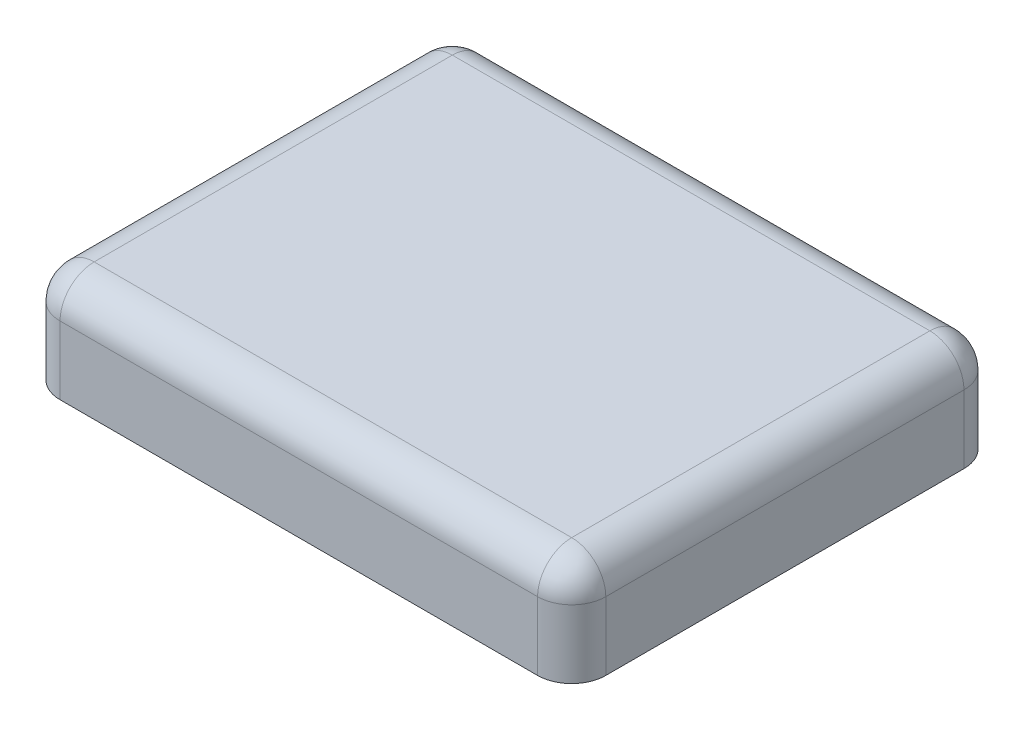
ISO-10303-21;
HEADER;
FILE_DESCRIPTION(('STEP AP214'),'2;1');
FILE_NAME('part.step','',(''),(''),'','','');
FILE_SCHEMA(('AUTOMOTIVE_DESIGN { 1 0 10303 214 1 1 1 1 }'));
ENDSEC;
DATA;
#1=APPLICATION_CONTEXT('core data for automotive mechanical design processes');
#2=APPLICATION_PROTOCOL_DEFINITION('international standard','automotive_design',2000,#1);
#3=PRODUCT_CONTEXT('',#1,'mechanical');
#4=PRODUCT('Part','Part','',(#3));
#5=PRODUCT_RELATED_PRODUCT_CATEGORY('part','',(#4));
#6=PRODUCT_DEFINITION_FORMATION('','',#4);
#7=PRODUCT_DEFINITION_CONTEXT('part definition',#1,'design');
#8=PRODUCT_DEFINITION('design','',#6,#7);
#9=PRODUCT_DEFINITION_SHAPE('','',#8);
#10=(LENGTH_UNIT() NAMED_UNIT(*) SI_UNIT(.MILLI.,.METRE.));
#11=(NAMED_UNIT(*) PLANE_ANGLE_UNIT() SI_UNIT($,.RADIAN.));
#12=(NAMED_UNIT(*) SI_UNIT($,.STERADIAN.) SOLID_ANGLE_UNIT());
#13=UNCERTAINTY_MEASURE_WITH_UNIT(LENGTH_MEASURE(1.E-05),#10,'distance_accuracy_value','');
#14=(GEOMETRIC_REPRESENTATION_CONTEXT(3) GLOBAL_UNCERTAINTY_ASSIGNED_CONTEXT((#13)) GLOBAL_UNIT_ASSIGNED_CONTEXT((#10,
#11,#12)) REPRESENTATION_CONTEXT('',''));
#15=CARTESIAN_POINT('',(0.,0.,0.));
#16=DIRECTION('',(0.,0.,1.));
#17=DIRECTION('',(1.,0.,0.));
#18=AXIS2_PLACEMENT_3D('',#15,#16,#17);
#19=CARTESIAN_POINT('',(1.6,0.6,-1.25));
#20=DIRECTION('',(-1.,0.,0.));
#21=DIRECTION('',(0.,0.,1.));
#22=AXIS2_PLACEMENT_3D('',#19,#20,#21);
#23=PLANE('',#22);
#24=DIRECTION('',(0.,-1.,0.));
#25=VECTOR('',#24,1.);
#26=CARTESIAN_POINT('',(1.6,0.6,-1.05));
#27=LINE('',#26,#25);
#28=CARTESIAN_POINT('',(1.6,0.,-1.05));
#29=VERTEX_POINT('',#28);
#30=CARTESIAN_POINT('',(1.6,0.4,-1.05));
#31=VERTEX_POINT('',#30);
#32=EDGE_CURVE('E122',#29,#31,#27,.F.);
#33=ORIENTED_EDGE('',*,*,#32,.T.);
#34=DIRECTION('',(0.,0.,-1.));
#35=VECTOR('',#34,1.);
#36=CARTESIAN_POINT('',(1.6,0.4,1.05));
#37=LINE('',#36,#35);
#38=CARTESIAN_POINT('',(1.6,0.4,1.05));
#39=VERTEX_POINT('',#38);
#40=EDGE_CURVE('E62',#31,#39,#37,.F.);
#41=ORIENTED_EDGE('',*,*,#40,.T.);
#42=DIRECTION('',(0.,-1.,0.));
#43=VECTOR('',#42,1.);
#44=CARTESIAN_POINT('',(1.6,0.6,1.05));
#45=LINE('',#44,#43);
#46=CARTESIAN_POINT('',(1.6,0.,1.05));
#47=VERTEX_POINT('',#46);
#48=EDGE_CURVE('E115',#39,#47,#45,.T.);
#49=ORIENTED_EDGE('',*,*,#48,.T.);
#50=DIRECTION('',(0.,0.,-1.));
#51=VECTOR('',#50,1.);
#52=CARTESIAN_POINT('',(1.6,0.,-1.25));
#53=LINE('',#52,#51);
#54=EDGE_CURVE('E118',#47,#29,#53,.T.);
#55=ORIENTED_EDGE('',*,*,#54,.T.);
#56=EDGE_LOOP('',(#33,#41,#49,#55));
#57=FACE_BOUND('',#56,.T.);
#58=ADVANCED_FACE('F38',(#57),#23,.F.);
#59=CARTESIAN_POINT('',(-1.6,0.6,-1.25));
#60=DIRECTION('',(0.,0.,1.));
#61=DIRECTION('',(1.,0.,0.));
#62=AXIS2_PLACEMENT_3D('',#59,#60,#61);
#63=PLANE('',#62);
#64=DIRECTION('',(0.,-1.,0.));
#65=VECTOR('',#64,1.);
#66=CARTESIAN_POINT('',(-1.4,0.6,-1.25));
#67=LINE('',#66,#65);
#68=CARTESIAN_POINT('',(-1.4,0.,-1.25));
#69=VERTEX_POINT('',#68);
#70=CARTESIAN_POINT('',(-1.4,0.4,-1.25));
#71=VERTEX_POINT('',#70);
#72=EDGE_CURVE('E155',#69,#71,#67,.F.);
#73=ORIENTED_EDGE('',*,*,#72,.T.);
#74=DIRECTION('',(-1.,0.,0.));
#75=VECTOR('',#74,1.);
#76=CARTESIAN_POINT('',(1.4,0.4,-1.25));
#77=LINE('',#76,#75);
#78=CARTESIAN_POINT('',(1.4,0.4,-1.25));
#79=VERTEX_POINT('',#78);
#80=EDGE_CURVE('E181',#71,#79,#77,.F.);
#81=ORIENTED_EDGE('',*,*,#80,.T.);
#82=DIRECTION('',(0.,-1.,0.));
#83=VECTOR('',#82,1.);
#84=CARTESIAN_POINT('',(1.4,0.6,-1.25));
#85=LINE('',#84,#83);
#86=CARTESIAN_POINT('',(1.4,0.,-1.25));
#87=VERTEX_POINT('',#86);
#88=EDGE_CURVE('E158',#79,#87,#85,.T.);
#89=ORIENTED_EDGE('',*,*,#88,.T.);
#90=DIRECTION('',(-1.,0.,0.));
#91=VECTOR('',#90,1.);
#92=CARTESIAN_POINT('',(-1.6,0.,-1.25));
#93=LINE('',#92,#91);
#94=EDGE_CURVE('E136',#87,#69,#93,.T.);
#95=ORIENTED_EDGE('',*,*,#94,.T.);
#96=EDGE_LOOP('',(#73,#81,#89,#95));
#97=FACE_BOUND('',#96,.T.);
#98=ADVANCED_FACE('F240',(#97),#63,.F.);
#99=CARTESIAN_POINT('',(-1.6,0.6,-1.25));
#100=DIRECTION('',(1.,0.,0.));
#101=DIRECTION('',(0.,0.,-1.));
#102=AXIS2_PLACEMENT_3D('',#99,#100,#101);
#103=PLANE('',#102);
#104=DIRECTION('',(0.,-1.,0.));
#105=VECTOR('',#104,1.);
#106=CARTESIAN_POINT('',(-1.6,0.6,1.05));
#107=LINE('',#106,#105);
#108=CARTESIAN_POINT('',(-1.6,0.,1.05));
#109=VERTEX_POINT('',#108);
#110=CARTESIAN_POINT('',(-1.6,0.4,1.05));
#111=VERTEX_POINT('',#110);
#112=EDGE_CURVE('E162',#109,#111,#107,.F.);
#113=ORIENTED_EDGE('',*,*,#112,.T.);
#114=DIRECTION('',(0.,0.,1.));
#115=VECTOR('',#114,1.);
#116=CARTESIAN_POINT('',(-1.6,0.4,-1.05));
#117=LINE('',#116,#115);
#118=CARTESIAN_POINT('',(-1.6,0.4,-1.05));
#119=VERTEX_POINT('',#118);
#120=EDGE_CURVE('E177',#111,#119,#117,.F.);
#121=ORIENTED_EDGE('',*,*,#120,.T.);
#122=DIRECTION('',(0.,-1.,0.));
#123=VECTOR('',#122,1.);
#124=CARTESIAN_POINT('',(-1.6,0.6,-1.05));
#125=LINE('',#124,#123);
#126=CARTESIAN_POINT('',(-1.6,0.,-1.05));
#127=VERTEX_POINT('',#126);
#128=EDGE_CURVE('E160',#119,#127,#125,.T.);
#129=ORIENTED_EDGE('',*,*,#128,.T.);
#130=DIRECTION('',(0.,0.,1.));
#131=VECTOR('',#130,1.);
#132=CARTESIAN_POINT('',(-1.6,0.,-1.25));
#133=LINE('',#132,#131);
#134=EDGE_CURVE('E139',#127,#109,#133,.T.);
#135=ORIENTED_EDGE('',*,*,#134,.T.);
#136=EDGE_LOOP('',(#113,#121,#129,#135));
#137=FACE_BOUND('',#136,.T.);
#138=ADVANCED_FACE('F245',(#137),#103,.F.);
#139=CARTESIAN_POINT('',(-1.6,0.6,1.25));
#140=DIRECTION('',(0.,0.,-1.));
#141=DIRECTION('',(-1.,0.,0.));
#142=AXIS2_PLACEMENT_3D('',#139,#140,#141);
#143=PLANE('',#142);
#144=DIRECTION('',(0.,-1.,0.));
#145=VECTOR('',#144,1.);
#146=CARTESIAN_POINT('',(1.4,0.6,1.25));
#147=LINE('',#146,#145);
#148=CARTESIAN_POINT('',(1.4,0.,1.25));
#149=VERTEX_POINT('',#148);
#150=CARTESIAN_POINT('',(1.4,0.4,1.25));
#151=VERTEX_POINT('',#150);
#152=EDGE_CURVE('E126',#149,#151,#147,.F.);
#153=ORIENTED_EDGE('',*,*,#152,.T.);
#154=DIRECTION('',(1.,0.,0.));
#155=VECTOR('',#154,1.);
#156=CARTESIAN_POINT('',(-1.4,0.4,1.25));
#157=LINE('',#156,#155);
#158=CARTESIAN_POINT('',(-1.4,0.4,1.25));
#159=VERTEX_POINT('',#158);
#160=EDGE_CURVE('E11',#151,#159,#157,.F.);
#161=ORIENTED_EDGE('',*,*,#160,.T.);
#162=DIRECTION('',(0.,-1.,0.));
#163=VECTOR('',#162,1.);
#164=CARTESIAN_POINT('',(-1.4,0.6,1.25));
#165=LINE('',#164,#163);
#166=CARTESIAN_POINT('',(-1.4,0.,1.25));
#167=VERTEX_POINT('',#166);
#168=EDGE_CURVE('E130',#159,#167,#165,.T.);
#169=ORIENTED_EDGE('',*,*,#168,.T.);
#170=DIRECTION('',(1.,0.,0.));
#171=VECTOR('',#170,1.);
#172=CARTESIAN_POINT('',(-1.6,0.,1.25));
#173=LINE('',#172,#171);
#174=EDGE_CURVE('E146',#167,#149,#173,.T.);
#175=ORIENTED_EDGE('',*,*,#174,.T.);
#176=EDGE_LOOP('',(#153,#161,#169,#175));
#177=FACE_BOUND('',#176,.T.);
#178=ADVANCED_FACE('F356',(#177),#143,.F.);
#179=CARTESIAN_POINT('',(0.,0.6,0.));
#180=DIRECTION('',(0.,1.,0.));
#181=DIRECTION('',(0.,0.,1.));
#182=AXIS2_PLACEMENT_3D('',#179,#180,#181);
#183=PLANE('',#182);
#184=DIRECTION('',(-1.,0.,0.));
#185=VECTOR('',#184,1.);
#186=CARTESIAN_POINT('',(-1.4,0.6,-1.05));
#187=LINE('',#186,#185);
#188=CARTESIAN_POINT('',(1.4,0.6,-1.05));
#189=VERTEX_POINT('',#188);
#190=CARTESIAN_POINT('',(-1.4,0.6,-1.05));
#191=VERTEX_POINT('',#190);
#192=EDGE_CURVE('E172',#189,#191,#187,.T.);
#193=ORIENTED_EDGE('',*,*,#192,.T.);
#194=DIRECTION('',(0.,0.,1.));
#195=VECTOR('',#194,1.);
#196=CARTESIAN_POINT('',(-1.4,0.6,1.05));
#197=LINE('',#196,#195);
#198=CARTESIAN_POINT('',(-1.4,0.6,1.05));
#199=VERTEX_POINT('',#198);
#200=EDGE_CURVE('E174',#191,#199,#197,.T.);
#201=ORIENTED_EDGE('',*,*,#200,.T.);
#202=DIRECTION('',(1.,0.,0.));
#203=VECTOR('',#202,1.);
#204=CARTESIAN_POINT('',(1.4,0.6,1.05));
#205=LINE('',#204,#203);
#206=CARTESIAN_POINT('',(1.4,0.6,1.05));
#207=VERTEX_POINT('',#206);
#208=EDGE_CURVE('E168',#199,#207,#205,.T.);
#209=ORIENTED_EDGE('',*,*,#208,.T.);
#210=DIRECTION('',(0.,0.,-1.));
#211=VECTOR('',#210,1.);
#212=CARTESIAN_POINT('',(1.4,0.6,-1.05));
#213=LINE('',#212,#211);
#214=EDGE_CURVE('E170',#207,#189,#213,.T.);
#215=ORIENTED_EDGE('',*,*,#214,.T.);
#216=EDGE_LOOP('',(#193,#201,#209,#215));
#217=FACE_BOUND('',#216,.T.);
#218=ADVANCED_FACE('F217',(#217),#183,.T.);
#219=CARTESIAN_POINT('',(0.,0.,0.));
#220=DIRECTION('',(0.,1.,0.));
#221=DIRECTION('',(0.,0.,1.));
#222=AXIS2_PLACEMENT_3D('',#219,#220,#221);
#223=PLANE('',#222);
#224=ORIENTED_EDGE('',*,*,#54,.F.);
#225=CARTESIAN_POINT('',(1.4,0.,1.05));
#226=DIRECTION('',(0.,1.,0.));
#227=DIRECTION('',(0.,0.,1.));
#228=AXIS2_PLACEMENT_3D('',#225,#226,#227);
#229=CIRCLE('',#228,0.2);
#230=EDGE_CURVE('E124',#47,#149,#229,.F.);
#231=ORIENTED_EDGE('',*,*,#230,.T.);
#232=ORIENTED_EDGE('',*,*,#174,.F.);
#233=CARTESIAN_POINT('',(-1.4,0.,1.05));
#234=DIRECTION('',(0.,1.,0.));
#235=DIRECTION('',(0.,0.,1.));
#236=AXIS2_PLACEMENT_3D('',#233,#234,#235);
#237=CIRCLE('',#236,0.2);
#238=EDGE_CURVE('E150',#167,#109,#237,.F.);
#239=ORIENTED_EDGE('',*,*,#238,.T.);
#240=ORIENTED_EDGE('',*,*,#134,.F.);
#241=CARTESIAN_POINT('',(-1.4,0.,-1.05));
#242=DIRECTION('',(0.,1.,0.));
#243=DIRECTION('',(0.,0.,1.));
#244=AXIS2_PLACEMENT_3D('',#241,#242,#243);
#245=CIRCLE('',#244,0.2);
#246=EDGE_CURVE('E121',#127,#69,#245,.F.);
#247=ORIENTED_EDGE('',*,*,#246,.T.);
#248=ORIENTED_EDGE('',*,*,#94,.F.);
#249=CARTESIAN_POINT('',(1.4,0.,-1.05));
#250=DIRECTION('',(0.,1.,0.));
#251=DIRECTION('',(0.,0.,1.));
#252=AXIS2_PLACEMENT_3D('',#249,#250,#251);
#253=CIRCLE('',#252,0.2);
#254=EDGE_CURVE('E131',#87,#29,#253,.F.);
#255=ORIENTED_EDGE('',*,*,#254,.T.);
#256=EDGE_LOOP('',(#224,#231,#232,#239,#240,#247,#248,#255));
#257=FACE_BOUND('',#256,.T.);
#258=ADVANCED_FACE('F133',(#257),#223,.F.);
#259=CARTESIAN_POINT('',(1.4,0.6,1.05));
#260=DIRECTION('',(0.,-1.,0.));
#261=DIRECTION('',(0.,0.,-1.));
#262=AXIS2_PLACEMENT_3D('',#259,#260,#261);
#263=CYLINDRICAL_SURFACE('',#262,0.2);
#264=ORIENTED_EDGE('',*,*,#48,.F.);
#265=CARTESIAN_POINT('',(1.4,0.4,1.05));
#266=DIRECTION('',(0.,-1.,0.));
#267=DIRECTION('',(0.,0.,-1.));
#268=AXIS2_PLACEMENT_3D('',#265,#266,#267);
#269=CIRCLE('',#268,0.2);
#270=EDGE_CURVE('E47',#39,#151,#269,.T.);
#271=ORIENTED_EDGE('',*,*,#270,.T.);
#272=ORIENTED_EDGE('',*,*,#152,.F.);
#273=ORIENTED_EDGE('',*,*,#230,.F.);
#274=EDGE_LOOP('',(#264,#271,#272,#273));
#275=FACE_BOUND('',#274,.T.);
#276=ADVANCED_FACE('F125',(#275),#263,.T.);
#277=CARTESIAN_POINT('',(1.4,0.6,-1.05));
#278=DIRECTION('',(0.,-1.,0.));
#279=DIRECTION('',(0.,0.,-1.));
#280=AXIS2_PLACEMENT_3D('',#277,#278,#279);
#281=CYLINDRICAL_SURFACE('',#280,0.2);
#282=ORIENTED_EDGE('',*,*,#88,.F.);
#283=CARTESIAN_POINT('',(1.4,0.4,-1.05));
#284=DIRECTION('',(0.,-1.,0.));
#285=DIRECTION('',(0.,0.,-1.));
#286=AXIS2_PLACEMENT_3D('',#283,#284,#285);
#287=CIRCLE('',#286,0.2);
#288=EDGE_CURVE('E183',#79,#31,#287,.T.);
#289=ORIENTED_EDGE('',*,*,#288,.T.);
#290=ORIENTED_EDGE('',*,*,#32,.F.);
#291=ORIENTED_EDGE('',*,*,#254,.F.);
#292=EDGE_LOOP('',(#282,#289,#290,#291));
#293=FACE_BOUND('',#292,.T.);
#294=ADVANCED_FACE('F252',(#293),#281,.T.);
#295=CARTESIAN_POINT('',(-1.4,0.6,1.05));
#296=DIRECTION('',(0.,-1.,0.));
#297=DIRECTION('',(0.,0.,-1.));
#298=AXIS2_PLACEMENT_3D('',#295,#296,#297);
#299=CYLINDRICAL_SURFACE('',#298,0.2);
#300=ORIENTED_EDGE('',*,*,#168,.F.);
#301=CARTESIAN_POINT('',(-1.4,0.4,1.05));
#302=DIRECTION('',(0.,-1.,0.));
#303=DIRECTION('',(0.,0.,-1.));
#304=AXIS2_PLACEMENT_3D('',#301,#302,#303);
#305=CIRCLE('',#304,0.2);
#306=EDGE_CURVE('E165',#159,#111,#305,.T.);
#307=ORIENTED_EDGE('',*,*,#306,.T.);
#308=ORIENTED_EDGE('',*,*,#112,.F.);
#309=ORIENTED_EDGE('',*,*,#238,.F.);
#310=EDGE_LOOP('',(#300,#307,#308,#309));
#311=FACE_BOUND('',#310,.T.);
#312=ADVANCED_FACE('F255',(#311),#299,.T.);
#313=CARTESIAN_POINT('',(-1.4,0.6,-1.05));
#314=DIRECTION('',(0.,-1.,0.));
#315=DIRECTION('',(0.,0.,-1.));
#316=AXIS2_PLACEMENT_3D('',#313,#314,#315);
#317=CYLINDRICAL_SURFACE('',#316,0.2);
#318=ORIENTED_EDGE('',*,*,#128,.F.);
#319=CARTESIAN_POINT('',(-1.4,0.4,-1.05));
#320=DIRECTION('',(0.,-1.,0.));
#321=DIRECTION('',(0.,0.,-1.));
#322=AXIS2_PLACEMENT_3D('',#319,#320,#321);
#323=CIRCLE('',#322,0.2);
#324=EDGE_CURVE('E179',#119,#71,#323,.T.);
#325=ORIENTED_EDGE('',*,*,#324,.T.);
#326=ORIENTED_EDGE('',*,*,#72,.F.);
#327=ORIENTED_EDGE('',*,*,#246,.F.);
#328=EDGE_LOOP('',(#318,#325,#326,#327));
#329=FACE_BOUND('',#328,.T.);
#330=ADVANCED_FACE('F259',(#329),#317,.T.);
#331=CARTESIAN_POINT('',(1.4,0.4,-1.05));
#332=DIRECTION('',(0.,1.,0.));
#333=DIRECTION('',(0.,0.,1.));
#334=AXIS2_PLACEMENT_3D('',#331,#332,#333);
#335=SPHERICAL_SURFACE('',#334,0.2);
#336=CARTESIAN_POINT('',(1.4,0.4,-1.05));
#337=DIRECTION('',(0.,0.,1.));
#338=DIRECTION('',(1.,0.,0.));
#339=AXIS2_PLACEMENT_3D('',#336,#337,#338);
#340=CIRCLE('',#339,0.2);
#341=EDGE_CURVE('E142',#31,#189,#340,.T.);
#342=ORIENTED_EDGE('',*,*,#341,.F.);
#343=ORIENTED_EDGE('',*,*,#288,.F.);
#344=CARTESIAN_POINT('',(1.4,0.4,-1.05));
#345=DIRECTION('',(-1.,0.,0.));
#346=DIRECTION('',(0.,0.,1.));
#347=AXIS2_PLACEMENT_3D('',#344,#345,#346);
#348=CIRCLE('',#347,0.2);
#349=EDGE_CURVE('E42',#189,#79,#348,.T.);
#350=ORIENTED_EDGE('',*,*,#349,.F.);
#351=EDGE_LOOP('',(#342,#343,#350));
#352=FACE_BOUND('',#351,.T.);
#353=ADVANCED_FACE('F40',(#352),#335,.T.);
#354=CARTESIAN_POINT('',(0.,0.4,-1.05));
#355=DIRECTION('',(1.,0.,0.));
#356=DIRECTION('',(0.,0.,-1.));
#357=AXIS2_PLACEMENT_3D('',#354,#355,#356);
#358=CYLINDRICAL_SURFACE('',#357,0.2);
#359=ORIENTED_EDGE('',*,*,#349,.T.);
#360=ORIENTED_EDGE('',*,*,#80,.F.);
#361=CARTESIAN_POINT('',(-1.4,0.4,-1.05));
#362=DIRECTION('',(-1.,0.,0.));
#363=DIRECTION('',(0.,0.,1.));
#364=AXIS2_PLACEMENT_3D('',#361,#362,#363);
#365=CIRCLE('',#364,0.2);
#366=EDGE_CURVE('E200',#191,#71,#365,.T.);
#367=ORIENTED_EDGE('',*,*,#366,.F.);
#368=ORIENTED_EDGE('',*,*,#192,.F.);
#369=EDGE_LOOP('',(#359,#360,#367,#368));
#370=FACE_BOUND('',#369,.T.);
#371=ADVANCED_FACE('F214',(#370),#358,.T.);
#372=CARTESIAN_POINT('',(1.4,0.4,0.));
#373=DIRECTION('',(0.,0.,1.));
#374=DIRECTION('',(1.,0.,0.));
#375=AXIS2_PLACEMENT_3D('',#372,#373,#374);
#376=CYLINDRICAL_SURFACE('',#375,0.2);
#377=ORIENTED_EDGE('',*,*,#341,.T.);
#378=ORIENTED_EDGE('',*,*,#214,.F.);
#379=CARTESIAN_POINT('',(1.4,0.4,1.05));
#380=DIRECTION('',(0.,0.,1.));
#381=DIRECTION('',(1.,0.,0.));
#382=AXIS2_PLACEMENT_3D('',#379,#380,#381);
#383=CIRCLE('',#382,0.2);
#384=EDGE_CURVE('E197',#39,#207,#383,.T.);
#385=ORIENTED_EDGE('',*,*,#384,.F.);
#386=ORIENTED_EDGE('',*,*,#40,.F.);
#387=EDGE_LOOP('',(#377,#378,#385,#386));
#388=FACE_BOUND('',#387,.T.);
#389=ADVANCED_FACE('F207',(#388),#376,.T.);
#390=CARTESIAN_POINT('',(-1.4,0.4,-1.05));
#391=DIRECTION('',(0.,1.,0.));
#392=DIRECTION('',(0.,0.,1.));
#393=AXIS2_PLACEMENT_3D('',#390,#391,#392);
#394=SPHERICAL_SURFACE('',#393,0.2);
#395=ORIENTED_EDGE('',*,*,#366,.T.);
#396=ORIENTED_EDGE('',*,*,#324,.F.);
#397=CARTESIAN_POINT('',(-1.4,0.4,-1.05));
#398=DIRECTION('',(0.,0.,1.));
#399=DIRECTION('',(1.,0.,0.));
#400=AXIS2_PLACEMENT_3D('',#397,#398,#399);
#401=CIRCLE('',#400,0.2);
#402=EDGE_CURVE('E194',#191,#119,#401,.T.);
#403=ORIENTED_EDGE('',*,*,#402,.F.);
#404=EDGE_LOOP('',(#395,#396,#403));
#405=FACE_BOUND('',#404,.T.);
#406=ADVANCED_FACE('F229',(#405),#394,.T.);
#407=CARTESIAN_POINT('',(1.4,0.4,1.05));
#408=DIRECTION('',(0.,1.,0.));
#409=DIRECTION('',(0.,0.,1.));
#410=AXIS2_PLACEMENT_3D('',#407,#408,#409);
#411=SPHERICAL_SURFACE('',#410,0.2);
#412=ORIENTED_EDGE('',*,*,#270,.F.);
#413=ORIENTED_EDGE('',*,*,#384,.T.);
#414=CARTESIAN_POINT('',(1.4,0.4,1.05));
#415=DIRECTION('',(-1.,0.,0.));
#416=DIRECTION('',(0.,0.,1.));
#417=AXIS2_PLACEMENT_3D('',#414,#415,#416);
#418=CIRCLE('',#417,0.2);
#419=EDGE_CURVE('E191',#151,#207,#418,.T.);
#420=ORIENTED_EDGE('',*,*,#419,.F.);
#421=EDGE_LOOP('',(#412,#413,#420));
#422=FACE_BOUND('',#421,.T.);
#423=ADVANCED_FACE('F226',(#422),#411,.T.);
#424=CARTESIAN_POINT('',(-1.4,0.4,0.));
#425=DIRECTION('',(0.,0.,-1.));
#426=DIRECTION('',(-1.,0.,0.));
#427=AXIS2_PLACEMENT_3D('',#424,#425,#426);
#428=CYLINDRICAL_SURFACE('',#427,0.2);
#429=ORIENTED_EDGE('',*,*,#402,.T.);
#430=ORIENTED_EDGE('',*,*,#120,.F.);
#431=CARTESIAN_POINT('',(-1.4,0.4,1.05));
#432=DIRECTION('',(0.,0.,1.));
#433=DIRECTION('',(1.,0.,0.));
#434=AXIS2_PLACEMENT_3D('',#431,#432,#433);
#435=CIRCLE('',#434,0.2);
#436=EDGE_CURVE('E189',#199,#111,#435,.T.);
#437=ORIENTED_EDGE('',*,*,#436,.F.);
#438=ORIENTED_EDGE('',*,*,#200,.F.);
#439=EDGE_LOOP('',(#429,#430,#437,#438));
#440=FACE_BOUND('',#439,.T.);
#441=ADVANCED_FACE('F228',(#440),#428,.T.);
#442=CARTESIAN_POINT('',(0.,0.4,1.05));
#443=DIRECTION('',(-1.,0.,0.));
#444=DIRECTION('',(0.,0.,1.));
#445=AXIS2_PLACEMENT_3D('',#442,#443,#444);
#446=CYLINDRICAL_SURFACE('',#445,0.2);
#447=ORIENTED_EDGE('',*,*,#419,.T.);
#448=ORIENTED_EDGE('',*,*,#208,.F.);
#449=CARTESIAN_POINT('',(-1.4,0.4,1.05));
#450=DIRECTION('',(-1.,0.,0.));
#451=DIRECTION('',(0.,0.,1.));
#452=AXIS2_PLACEMENT_3D('',#449,#450,#451);
#453=CIRCLE('',#452,0.2);
#454=EDGE_CURVE('E187',#159,#199,#453,.T.);
#455=ORIENTED_EDGE('',*,*,#454,.F.);
#456=ORIENTED_EDGE('',*,*,#160,.F.);
#457=EDGE_LOOP('',(#447,#448,#455,#456));
#458=FACE_BOUND('',#457,.T.);
#459=ADVANCED_FACE('F222',(#458),#446,.T.);
#460=CARTESIAN_POINT('',(-1.4,0.4,1.05));
#461=DIRECTION('',(0.,1.,0.));
#462=DIRECTION('',(0.,0.,1.));
#463=AXIS2_PLACEMENT_3D('',#460,#461,#462);
#464=SPHERICAL_SURFACE('',#463,0.2);
#465=ORIENTED_EDGE('',*,*,#436,.T.);
#466=ORIENTED_EDGE('',*,*,#306,.F.);
#467=ORIENTED_EDGE('',*,*,#454,.T.);
#468=EDGE_LOOP('',(#465,#466,#467));
#469=FACE_BOUND('',#468,.T.);
#470=ADVANCED_FACE('F264',(#469),#464,.T.);
#471=CLOSED_SHELL('',(#58,#98,#138,#178,#218,#258,#276,#294,#312,#330,#353,#371,#389,#406,#423,
#441,#459,#470));
#472=MANIFOLD_SOLID_BREP('B2',#471);
#473=ADVANCED_BREP_SHAPE_REPRESENTATION('',(#18,#472),#14);
#474=SHAPE_DEFINITION_REPRESENTATION(#9,#473);
ENDSEC;
END-ISO-10303-21;
